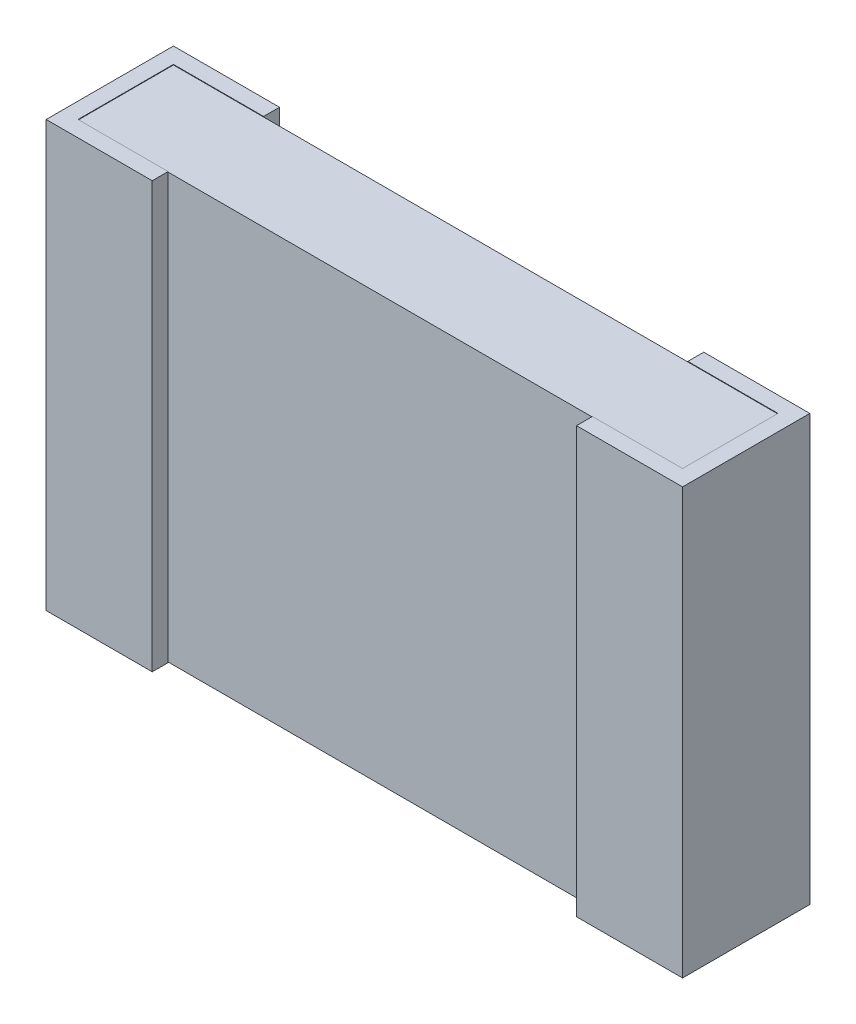
ISO-10303-21;
HEADER;
FILE_DESCRIPTION(('STEP AP214'),'2;1');
FILE_NAME('part.step','',(''),(''),'','','');
FILE_SCHEMA(('AUTOMOTIVE_DESIGN { 1 0 10303 214 1 1 1 1 }'));
ENDSEC;
DATA;
#1=APPLICATION_CONTEXT('core data for automotive mechanical design processes');
#2=APPLICATION_PROTOCOL_DEFINITION('international standard','automotive_design',2000,#1);
#3=PRODUCT_CONTEXT('',#1,'mechanical');
#4=PRODUCT('Part','Part','',(#3));
#5=PRODUCT_RELATED_PRODUCT_CATEGORY('part','',(#4));
#6=PRODUCT_DEFINITION_FORMATION('','',#4);
#7=PRODUCT_DEFINITION_CONTEXT('part definition',#1,'design');
#8=PRODUCT_DEFINITION('design','',#6,#7);
#9=PRODUCT_DEFINITION_SHAPE('','',#8);
#10=(LENGTH_UNIT() NAMED_UNIT(*) SI_UNIT(.MILLI.,.METRE.));
#11=(NAMED_UNIT(*) PLANE_ANGLE_UNIT() SI_UNIT($,.RADIAN.));
#12=(NAMED_UNIT(*) SI_UNIT($,.STERADIAN.) SOLID_ANGLE_UNIT());
#13=UNCERTAINTY_MEASURE_WITH_UNIT(LENGTH_MEASURE(1.E-05),#10,'distance_accuracy_value','');
#14=(GEOMETRIC_REPRESENTATION_CONTEXT(3) GLOBAL_UNCERTAINTY_ASSIGNED_CONTEXT((#13)) GLOBAL_UNIT_ASSIGNED_CONTEXT((#10,
#11,#12)) REPRESENTATION_CONTEXT('',''));
#15=CARTESIAN_POINT('',(0.,0.,0.));
#16=DIRECTION('',(0.,0.,1.));
#17=DIRECTION('',(1.,0.,0.));
#18=AXIS2_PLACEMENT_3D('',#15,#16,#17);
#19=CARTESIAN_POINT('',(0.0762,1.016,0.533400000000122));
#20=DIRECTION('',(0.,0.,-1.));
#21=DIRECTION('',(-1.,0.,0.));
#22=AXIS2_PLACEMENT_3D('',#19,#20,#21);
#23=PLANE('',#22);
#24=DIRECTION('',(0.,1.,0.));
#25=VECTOR('',#24,1.);
#26=CARTESIAN_POINT('',(2.54,-1.01854,0.533400000000122));
#27=LINE('',#26,#25);
#28=CARTESIAN_POINT('',(2.54,-1.016,0.533400000000122));
#29=VERTEX_POINT('',#28);
#30=CARTESIAN_POINT('',(2.54,1.016,0.533400000000122));
#31=VERTEX_POINT('',#30);
#32=EDGE_CURVE('E57',#29,#31,#27,.T.);
#33=ORIENTED_EDGE('',*,*,#32,.T.);
#34=DIRECTION('',(1.,0.,0.));
#35=VECTOR('',#34,1.);
#36=CARTESIAN_POINT('',(0.0762,1.016,0.533400000000122));
#37=LINE('',#36,#35);
#38=CARTESIAN_POINT('',(0.508,1.016,0.533400000000122));
#39=VERTEX_POINT('',#38);
#40=EDGE_CURVE('E41',#39,#31,#37,.T.);
#41=ORIENTED_EDGE('',*,*,#40,.F.);
#42=DIRECTION('',(0.,1.,0.));
#43=VECTOR('',#42,1.);
#44=CARTESIAN_POINT('',(0.508,-1.01854,0.533400000000122));
#45=LINE('',#44,#43);
#46=CARTESIAN_POINT('',(0.508,-1.016,0.533400000000122));
#47=VERTEX_POINT('',#46);
#48=EDGE_CURVE('E351',#47,#39,#45,.T.);
#49=ORIENTED_EDGE('',*,*,#48,.F.);
#50=DIRECTION('',(1.,0.,0.));
#51=VECTOR('',#50,1.);
#52=CARTESIAN_POINT('',(0.0762,-1.016,0.533400000000122));
#53=LINE('',#52,#51);
#54=EDGE_CURVE('E370',#47,#29,#53,.T.);
#55=ORIENTED_EDGE('',*,*,#54,.T.);
#56=EDGE_LOOP('',(#33,#41,#49,#55));
#57=FACE_BOUND('',#56,.T.);
#58=ADVANCED_FACE('F32',(#57),#23,.F.);
#59=CARTESIAN_POINT('',(2.9718,1.016,0.0762000000001228));
#60=DIRECTION('',(0.,0.,1.));
#61=DIRECTION('',(1.,0.,0.));
#62=AXIS2_PLACEMENT_3D('',#59,#60,#61);
#63=PLANE('',#62);
#64=DIRECTION('',(0.,1.,0.));
#65=VECTOR('',#64,1.);
#66=CARTESIAN_POINT('',(2.54000000000002,-1.01854,0.0762000000001225));
#67=LINE('',#66,#65);
#68=CARTESIAN_POINT('',(2.54000000000002,-1.016,0.0762000000001225));
#69=VERTEX_POINT('',#68);
#70=CARTESIAN_POINT('',(2.54000000000002,1.016,0.0762000000001228));
#71=VERTEX_POINT('',#70);
#72=EDGE_CURVE('E277',#69,#71,#67,.T.);
#73=ORIENTED_EDGE('',*,*,#72,.F.);
#74=DIRECTION('',(-1.,0.,0.));
#75=VECTOR('',#74,1.);
#76=CARTESIAN_POINT('',(2.9718,-1.016,0.0762000000001228));
#77=LINE('',#76,#75);
#78=CARTESIAN_POINT('',(0.507999999999976,-1.016,0.0762000000001225));
#79=VERTEX_POINT('',#78);
#80=EDGE_CURVE('E368',#69,#79,#77,.T.);
#81=ORIENTED_EDGE('',*,*,#80,.T.);
#82=DIRECTION('',(0.,1.,0.));
#83=VECTOR('',#82,1.);
#84=CARTESIAN_POINT('',(0.507999999999976,-1.01854,0.0762000000001225));
#85=LINE('',#84,#83);
#86=CARTESIAN_POINT('',(0.507999999999976,1.016,0.0762000000001225));
#87=VERTEX_POINT('',#86);
#88=EDGE_CURVE('E338',#79,#87,#85,.T.);
#89=ORIENTED_EDGE('',*,*,#88,.T.);
#90=DIRECTION('',(-1.,0.,0.));
#91=VECTOR('',#90,1.);
#92=CARTESIAN_POINT('',(2.9718,1.016,0.0762000000001228));
#93=LINE('',#92,#91);
#94=EDGE_CURVE('E49',#71,#87,#93,.T.);
#95=ORIENTED_EDGE('',*,*,#94,.F.);
#96=EDGE_LOOP('',(#73,#81,#89,#95));
#97=FACE_BOUND('',#96,.T.);
#98=ADVANCED_FACE('F34',(#97),#63,.F.);
#99=CARTESIAN_POINT('',(0.0762000000000002,1.016,0.0762000000001225));
#100=DIRECTION('',(0.,1.,0.));
#101=DIRECTION('',(0.,0.,1.));
#102=AXIS2_PLACEMENT_3D('',#99,#100,#101);
#103=PLANE('',#102);
#104=DIRECTION('',(0.,0.,-1.));
#105=VECTOR('',#104,1.);
#106=CARTESIAN_POINT('',(0.0762,1.016,0.533400000000122));
#107=LINE('',#106,#105);
#108=CARTESIAN_POINT('',(0.0762,1.016,0.533400000000122));
#109=VERTEX_POINT('',#108);
#110=CARTESIAN_POINT('',(0.0762000000000002,1.016,0.0762000000001224));
#111=VERTEX_POINT('',#110);
#112=EDGE_CURVE('E355',#109,#111,#107,.T.);
#113=ORIENTED_EDGE('',*,*,#112,.F.);
#114=EDGE_CURVE('E11',#109,#39,#37,.T.);
#115=ORIENTED_EDGE('',*,*,#114,.T.);
#116=ORIENTED_EDGE('',*,*,#40,.T.);
#117=DIRECTION('',(-1.,0.,0.));
#118=VECTOR('',#117,1.);
#119=CARTESIAN_POINT('',(0.0762000000000002,1.016,0.533400000000122));
#120=LINE('',#119,#118);
#121=CARTESIAN_POINT('',(2.9718,1.016,0.533400000000122));
#122=VERTEX_POINT('',#121);
#123=EDGE_CURVE('E208',#122,#31,#120,.T.);
#124=ORIENTED_EDGE('',*,*,#123,.F.);
#125=DIRECTION('',(0.,0.,1.));
#126=VECTOR('',#125,1.);
#127=CARTESIAN_POINT('',(2.9718,1.016,0.0762000000001228));
#128=LINE('',#127,#126);
#129=CARTESIAN_POINT('',(2.9718,1.016,0.0762000000001228));
#130=VERTEX_POINT('',#129);
#131=EDGE_CURVE('E359',#130,#122,#128,.T.);
#132=ORIENTED_EDGE('',*,*,#131,.F.);
#133=EDGE_CURVE('E357',#130,#71,#93,.T.);
#134=ORIENTED_EDGE('',*,*,#133,.T.);
#135=ORIENTED_EDGE('',*,*,#94,.T.);
#136=DIRECTION('',(-1.,0.,0.));
#137=VECTOR('',#136,1.);
#138=CARTESIAN_POINT('',(0.0762000000000002,1.016,0.0762000000001224));
#139=LINE('',#138,#137);
#140=EDGE_CURVE('E350',#87,#111,#139,.T.);
#141=ORIENTED_EDGE('',*,*,#140,.T.);
#142=EDGE_LOOP('',(#113,#115,#116,#124,#132,#134,#135,#141));
#143=FACE_BOUND('',#142,.T.);
#144=ADVANCED_FACE('F387',(#143),#103,.T.);
#145=CARTESIAN_POINT('',(0.0762000000000002,-1.016,0.0762000000001225));
#146=DIRECTION('',(0.,1.,0.));
#147=DIRECTION('',(0.,0.,1.));
#148=AXIS2_PLACEMENT_3D('',#145,#146,#147);
#149=PLANE('',#148);
#150=DIRECTION('',(0.,0.,-1.));
#151=VECTOR('',#150,1.);
#152=CARTESIAN_POINT('',(0.0762,-1.016,0.533400000000122));
#153=LINE('',#152,#151);
#154=CARTESIAN_POINT('',(0.0762,-1.016,0.533400000000122));
#155=VERTEX_POINT('',#154);
#156=CARTESIAN_POINT('',(0.0762000000000002,-1.016,0.0762000000001225));
#157=VERTEX_POINT('',#156);
#158=EDGE_CURVE('E354',#155,#157,#153,.T.);
#159=ORIENTED_EDGE('',*,*,#158,.T.);
#160=EDGE_CURVE('E364',#79,#157,#77,.T.);
#161=ORIENTED_EDGE('',*,*,#160,.F.);
#162=ORIENTED_EDGE('',*,*,#80,.F.);
#163=CARTESIAN_POINT('',(2.9718,-1.016,0.0762000000001228));
#164=VERTEX_POINT('',#163);
#165=EDGE_CURVE('E365',#164,#69,#77,.T.);
#166=ORIENTED_EDGE('',*,*,#165,.F.);
#167=DIRECTION('',(0.,0.,1.));
#168=VECTOR('',#167,1.);
#169=CARTESIAN_POINT('',(2.9718,-1.016,0.0762000000001228));
#170=LINE('',#169,#168);
#171=CARTESIAN_POINT('',(2.9718,-1.016,0.533400000000122));
#172=VERTEX_POINT('',#171);
#173=EDGE_CURVE('E367',#164,#172,#170,.T.);
#174=ORIENTED_EDGE('',*,*,#173,.T.);
#175=EDGE_CURVE('E204',#29,#172,#53,.T.);
#176=ORIENTED_EDGE('',*,*,#175,.F.);
#177=ORIENTED_EDGE('',*,*,#54,.F.);
#178=EDGE_CURVE('E36',#155,#47,#53,.T.);
#179=ORIENTED_EDGE('',*,*,#178,.F.);
#180=EDGE_LOOP('',(#159,#161,#162,#166,#174,#176,#177,#179));
#181=FACE_BOUND('',#180,.T.);
#182=ADVANCED_FACE('F384',(#181),#149,.F.);
#183=CARTESIAN_POINT('',(0.0762,-1.01854,0.533400000000122));
#184=DIRECTION('',(0.,0.,1.));
#185=DIRECTION('',(1.,0.,0.));
#186=AXIS2_PLACEMENT_3D('',#183,#184,#185);
#187=PLANE('',#186);
#188=DIRECTION('',(0.,1.,0.));
#189=VECTOR('',#188,1.);
#190=CARTESIAN_POINT('',(0.0762,-1.01854,0.533400000000122));
#191=LINE('',#190,#189);
#192=CARTESIAN_POINT('',(0.0762,-1.01854,0.533400000000122));
#193=VERTEX_POINT('',#192);
#194=EDGE_CURVE('E327',#193,#155,#191,.T.);
#195=ORIENTED_EDGE('',*,*,#194,.T.);
#196=ORIENTED_EDGE('',*,*,#178,.T.);
#197=CARTESIAN_POINT('',(0.508,-1.01854,0.533400000000122));
#198=VERTEX_POINT('',#197);
#199=EDGE_CURVE('E347',#198,#47,#45,.T.);
#200=ORIENTED_EDGE('',*,*,#199,.F.);
#201=DIRECTION('',(1.,0.,0.));
#202=VECTOR('',#201,1.);
#203=CARTESIAN_POINT('',(0.0762,-1.01854,0.533400000000122));
#204=LINE('',#203,#202);
#205=EDGE_CURVE('E282',#193,#198,#204,.T.);
#206=ORIENTED_EDGE('',*,*,#205,.F.);
#207=EDGE_LOOP('',(#195,#196,#200,#206));
#208=FACE_BOUND('',#207,.T.);
#209=ADVANCED_FACE('F374',(#208),#187,.F.);
#210=CARTESIAN_POINT('',(0.507999999999976,-1.01854,0.0762000000001225));
#211=DIRECTION('',(0.,0.,-1.));
#212=DIRECTION('',(-1.,0.,0.));
#213=AXIS2_PLACEMENT_3D('',#210,#211,#212);
#214=PLANE('',#213);
#215=CARTESIAN_POINT('',(0.507999999999976,-1.01854,0.0762000000001225));
#216=VERTEX_POINT('',#215);
#217=EDGE_CURVE('E334',#216,#79,#85,.T.);
#218=ORIENTED_EDGE('',*,*,#217,.T.);
#219=ORIENTED_EDGE('',*,*,#160,.T.);
#220=DIRECTION('',(0.,1.,0.));
#221=VECTOR('',#220,1.);
#222=CARTESIAN_POINT('',(0.0762000000000002,-1.01854,0.0762000000001224));
#223=LINE('',#222,#221);
#224=CARTESIAN_POINT('',(0.0762000000000002,-1.01854,0.0762000000001224));
#225=VERTEX_POINT('',#224);
#226=EDGE_CURVE('E331',#225,#157,#223,.T.);
#227=ORIENTED_EDGE('',*,*,#226,.F.);
#228=DIRECTION('',(-1.,0.,0.));
#229=VECTOR('',#228,1.);
#230=CARTESIAN_POINT('',(0.507999999999976,-1.01854,0.0762000000001225));
#231=LINE('',#230,#229);
#232=EDGE_CURVE('E300',#216,#225,#231,.T.);
#233=ORIENTED_EDGE('',*,*,#232,.F.);
#234=EDGE_LOOP('',(#218,#219,#227,#233));
#235=FACE_BOUND('',#234,.T.);
#236=ADVANCED_FACE('F393',(#235),#214,.F.);
#237=CARTESIAN_POINT('',(0.0762000000000002,-1.01854,0.0762000000001224));
#238=DIRECTION('',(-1.,0.,0.));
#239=DIRECTION('',(0.,0.,1.));
#240=AXIS2_PLACEMENT_3D('',#237,#238,#239);
#241=PLANE('',#240);
#242=ORIENTED_EDGE('',*,*,#226,.T.);
#243=ORIENTED_EDGE('',*,*,#158,.F.);
#244=ORIENTED_EDGE('',*,*,#194,.F.);
#245=DIRECTION('',(0.,0.,1.));
#246=VECTOR('',#245,1.);
#247=CARTESIAN_POINT('',(0.0762000000000002,-1.01854,0.0762000000001224));
#248=LINE('',#247,#246);
#249=EDGE_CURVE('E302',#225,#193,#248,.T.);
#250=ORIENTED_EDGE('',*,*,#249,.F.);
#251=EDGE_LOOP('',(#242,#243,#244,#250));
#252=FACE_BOUND('',#251,.T.);
#253=ADVANCED_FACE('F479',(#252),#241,.F.);
#254=ORIENTED_EDGE('',*,*,#114,.F.);
#255=CARTESIAN_POINT('',(0.0762,1.01854,0.533400000000122));
#256=VERTEX_POINT('',#255);
#257=EDGE_CURVE('E304',#109,#256,#191,.T.);
#258=ORIENTED_EDGE('',*,*,#257,.T.);
#259=DIRECTION('',(1.,0.,0.));
#260=VECTOR('',#259,1.);
#261=CARTESIAN_POINT('',(0.0762,1.01854,0.533400000000122));
#262=LINE('',#261,#260);
#263=CARTESIAN_POINT('',(0.508,1.01854,0.533400000000122));
#264=VERTEX_POINT('',#263);
#265=EDGE_CURVE('E281',#256,#264,#262,.T.);
#266=ORIENTED_EDGE('',*,*,#265,.T.);
#267=EDGE_CURVE('E346',#39,#264,#45,.T.);
#268=ORIENTED_EDGE('',*,*,#267,.F.);
#269=EDGE_LOOP('',(#254,#258,#266,#268));
#270=FACE_BOUND('',#269,.T.);
#271=ADVANCED_FACE('F395',(#270),#187,.F.);
#272=CARTESIAN_POINT('',(0.508,-1.01854,0.609599999999878));
#273=DIRECTION('',(1.,0.,0.));
#274=DIRECTION('',(0.,0.,-1.));
#275=AXIS2_PLACEMENT_3D('',#272,#273,#274);
#276=PLANE('',#275);
#277=DIRECTION('',(0.,0.,-1.));
#278=VECTOR('',#277,1.);
#279=CARTESIAN_POINT('',(0.508,1.01854,0.609599999999878));
#280=LINE('',#279,#278);
#281=CARTESIAN_POINT('',(0.508,1.01854,0.609599999999878));
#282=VERTEX_POINT('',#281);
#283=EDGE_CURVE('E307',#282,#264,#280,.T.);
#284=ORIENTED_EDGE('',*,*,#283,.F.);
#285=DIRECTION('',(0.,1.,0.));
#286=VECTOR('',#285,1.);
#287=CARTESIAN_POINT('',(0.508,-1.01854,0.609599999999878));
#288=LINE('',#287,#286);
#289=CARTESIAN_POINT('',(0.508,-1.01854,0.609599999999878));
#290=VERTEX_POINT('',#289);
#291=EDGE_CURVE('E344',#290,#282,#288,.T.);
#292=ORIENTED_EDGE('',*,*,#291,.F.);
#293=DIRECTION('',(0.,0.,-1.));
#294=VECTOR('',#293,1.);
#295=CARTESIAN_POINT('',(0.508,-1.01854,0.609599999999878));
#296=LINE('',#295,#294);
#297=EDGE_CURVE('E284',#290,#198,#296,.T.);
#298=ORIENTED_EDGE('',*,*,#297,.T.);
#299=ORIENTED_EDGE('',*,*,#199,.T.);
#300=ORIENTED_EDGE('',*,*,#48,.T.);
#301=ORIENTED_EDGE('',*,*,#267,.T.);
#302=EDGE_LOOP('',(#284,#292,#298,#299,#300,#301));
#303=FACE_BOUND('',#302,.T.);
#304=ADVANCED_FACE('F382',(#303),#276,.T.);
#305=CARTESIAN_POINT('',(0.,-1.01854,0.609599999999878));
#306=DIRECTION('',(0.,0.,1.));
#307=DIRECTION('',(1.,0.,0.));
#308=AXIS2_PLACEMENT_3D('',#305,#306,#307);
#309=PLANE('',#308);
#310=DIRECTION('',(1.,0.,0.));
#311=VECTOR('',#310,1.);
#312=CARTESIAN_POINT('',(0.,1.01854,0.609599999999878));
#313=LINE('',#312,#311);
#314=CARTESIAN_POINT('',(0.,1.01854,0.609599999999878));
#315=VERTEX_POINT('',#314);
#316=EDGE_CURVE('E310',#315,#282,#313,.T.);
#317=ORIENTED_EDGE('',*,*,#316,.F.);
#318=DIRECTION('',(0.,1.,0.));
#319=VECTOR('',#318,1.);
#320=CARTESIAN_POINT('',(0.,-1.01854,0.609599999999878));
#321=LINE('',#320,#319);
#322=CARTESIAN_POINT('',(0.,-1.01854,0.609599999999878));
#323=VERTEX_POINT('',#322);
#324=EDGE_CURVE('E342',#323,#315,#321,.T.);
#325=ORIENTED_EDGE('',*,*,#324,.F.);
#326=DIRECTION('',(1.,0.,0.));
#327=VECTOR('',#326,1.);
#328=CARTESIAN_POINT('',(0.,-1.01854,0.609599999999878));
#329=LINE('',#328,#327);
#330=EDGE_CURVE('E288',#323,#290,#329,.T.);
#331=ORIENTED_EDGE('',*,*,#330,.T.);
#332=ORIENTED_EDGE('',*,*,#291,.T.);
#333=EDGE_LOOP('',(#317,#325,#331,#332));
#334=FACE_BOUND('',#333,.T.);
#335=ADVANCED_FACE('F494',(#334),#309,.T.);
#336=CARTESIAN_POINT('',(0.,-1.01854,0.));
#337=DIRECTION('',(-1.,0.,0.));
#338=DIRECTION('',(0.,0.,1.));
#339=AXIS2_PLACEMENT_3D('',#336,#337,#338);
#340=PLANE('',#339);
#341=DIRECTION('',(0.,0.,1.));
#342=VECTOR('',#341,1.);
#343=CARTESIAN_POINT('',(0.,1.01854,0.));
#344=LINE('',#343,#342);
#345=CARTESIAN_POINT('',(0.,1.01854,0.));
#346=VERTEX_POINT('',#345);
#347=EDGE_CURVE('E313',#346,#315,#344,.T.);
#348=ORIENTED_EDGE('',*,*,#347,.F.);
#349=DIRECTION('',(0.,1.,0.));
#350=VECTOR('',#349,1.);
#351=CARTESIAN_POINT('',(0.,-1.01854,0.));
#352=LINE('',#351,#350);
#353=CARTESIAN_POINT('',(0.,-1.01854,0.));
#354=VERTEX_POINT('',#353);
#355=EDGE_CURVE('E340',#354,#346,#352,.T.);
#356=ORIENTED_EDGE('',*,*,#355,.F.);
#357=DIRECTION('',(0.,0.,1.));
#358=VECTOR('',#357,1.);
#359=CARTESIAN_POINT('',(0.,-1.01854,0.));
#360=LINE('',#359,#358);
#361=EDGE_CURVE('E291',#354,#323,#360,.T.);
#362=ORIENTED_EDGE('',*,*,#361,.T.);
#363=ORIENTED_EDGE('',*,*,#324,.T.);
#364=EDGE_LOOP('',(#348,#356,#362,#363));
#365=FACE_BOUND('',#364,.T.);
#366=ADVANCED_FACE('F490',(#365),#340,.T.);
#367=CARTESIAN_POINT('',(0.507999999999976,-1.01854,0.));
#368=DIRECTION('',(0.,0.,-1.));
#369=DIRECTION('',(-1.,0.,0.));
#370=AXIS2_PLACEMENT_3D('',#367,#368,#369);
#371=PLANE('',#370);
#372=DIRECTION('',(-1.,0.,0.));
#373=VECTOR('',#372,1.);
#374=CARTESIAN_POINT('',(0.507999999999976,1.01854,0.));
#375=LINE('',#374,#373);
#376=CARTESIAN_POINT('',(0.507999999999976,1.01854,0.));
#377=VERTEX_POINT('',#376);
#378=EDGE_CURVE('E316',#377,#346,#375,.T.);
#379=ORIENTED_EDGE('',*,*,#378,.F.);
#380=DIRECTION('',(0.,1.,0.));
#381=VECTOR('',#380,1.);
#382=CARTESIAN_POINT('',(0.507999999999976,-1.01854,0.));
#383=LINE('',#382,#381);
#384=CARTESIAN_POINT('',(0.507999999999976,-1.01854,0.));
#385=VERTEX_POINT('',#384);
#386=EDGE_CURVE('E337',#385,#377,#383,.T.);
#387=ORIENTED_EDGE('',*,*,#386,.F.);
#388=DIRECTION('',(-1.,0.,0.));
#389=VECTOR('',#388,1.);
#390=CARTESIAN_POINT('',(0.507999999999976,-1.01854,0.));
#391=LINE('',#390,#389);
#392=EDGE_CURVE('E294',#385,#354,#391,.T.);
#393=ORIENTED_EDGE('',*,*,#392,.T.);
#394=ORIENTED_EDGE('',*,*,#355,.T.);
#395=EDGE_LOOP('',(#379,#387,#393,#394));
#396=FACE_BOUND('',#395,.T.);
#397=ADVANCED_FACE('F486',(#396),#371,.T.);
#398=CARTESIAN_POINT('',(0.507999999999976,-1.01854,0.0762000000001225));
#399=DIRECTION('',(1.,0.,0.));
#400=DIRECTION('',(0.,0.,-1.));
#401=AXIS2_PLACEMENT_3D('',#398,#399,#400);
#402=PLANE('',#401);
#403=DIRECTION('',(0.,0.,-1.));
#404=VECTOR('',#403,1.);
#405=CARTESIAN_POINT('',(0.507999999999976,1.01854,0.0762000000001225));
#406=LINE('',#405,#404);
#407=CARTESIAN_POINT('',(0.507999999999976,1.01854,0.0762000000001225));
#408=VERTEX_POINT('',#407);
#409=EDGE_CURVE('E319',#408,#377,#406,.T.);
#410=ORIENTED_EDGE('',*,*,#409,.F.);
#411=EDGE_CURVE('E333',#87,#408,#85,.T.);
#412=ORIENTED_EDGE('',*,*,#411,.F.);
#413=ORIENTED_EDGE('',*,*,#88,.F.);
#414=ORIENTED_EDGE('',*,*,#217,.F.);
#415=DIRECTION('',(0.,0.,-1.));
#416=VECTOR('',#415,1.);
#417=CARTESIAN_POINT('',(0.507999999999976,-1.01854,0.0762000000001225));
#418=LINE('',#417,#416);
#419=EDGE_CURVE('E297',#216,#385,#418,.T.);
#420=ORIENTED_EDGE('',*,*,#419,.T.);
#421=ORIENTED_EDGE('',*,*,#386,.T.);
#422=EDGE_LOOP('',(#410,#412,#413,#414,#420,#421));
#423=FACE_BOUND('',#422,.T.);
#424=ADVANCED_FACE('F482',(#423),#402,.T.);
#425=ORIENTED_EDGE('',*,*,#140,.F.);
#426=ORIENTED_EDGE('',*,*,#411,.T.);
#427=DIRECTION('',(-1.,0.,0.));
#428=VECTOR('',#427,1.);
#429=CARTESIAN_POINT('',(0.507999999999976,1.01854,0.0762000000001225));
#430=LINE('',#429,#428);
#431=CARTESIAN_POINT('',(0.0762000000000002,1.01854,0.0762000000001224));
#432=VERTEX_POINT('',#431);
#433=EDGE_CURVE('E322',#408,#432,#430,.T.);
#434=ORIENTED_EDGE('',*,*,#433,.T.);
#435=EDGE_CURVE('E330',#111,#432,#223,.T.);
#436=ORIENTED_EDGE('',*,*,#435,.F.);
#437=EDGE_LOOP('',(#425,#426,#434,#436));
#438=FACE_BOUND('',#437,.T.);
#439=ADVANCED_FACE('F477',(#438),#214,.F.);
#440=ORIENTED_EDGE('',*,*,#112,.T.);
#441=ORIENTED_EDGE('',*,*,#435,.T.);
#442=DIRECTION('',(0.,0.,1.));
#443=VECTOR('',#442,1.);
#444=CARTESIAN_POINT('',(0.0762000000000002,1.01854,0.0762000000001224));
#445=LINE('',#444,#443);
#446=EDGE_CURVE('E285',#432,#256,#445,.T.);
#447=ORIENTED_EDGE('',*,*,#446,.T.);
#448=ORIENTED_EDGE('',*,*,#257,.F.);
#449=EDGE_LOOP('',(#440,#441,#447,#448));
#450=FACE_BOUND('',#449,.T.);
#451=ADVANCED_FACE('F470',(#450),#241,.F.);
#452=CARTESIAN_POINT('',(0.508,-1.01854,0.533400000000122));
#453=DIRECTION('',(0.,1.,0.));
#454=DIRECTION('',(0.,0.,1.));
#455=AXIS2_PLACEMENT_3D('',#452,#453,#454);
#456=PLANE('',#455);
#457=ORIENTED_EDGE('',*,*,#205,.T.);
#458=ORIENTED_EDGE('',*,*,#297,.F.);
#459=ORIENTED_EDGE('',*,*,#330,.F.);
#460=ORIENTED_EDGE('',*,*,#361,.F.);
#461=ORIENTED_EDGE('',*,*,#392,.F.);
#462=ORIENTED_EDGE('',*,*,#419,.F.);
#463=ORIENTED_EDGE('',*,*,#232,.T.);
#464=ORIENTED_EDGE('',*,*,#249,.T.);
#465=EDGE_LOOP('',(#457,#458,#459,#460,#461,#462,#463,#464));
#466=FACE_BOUND('',#465,.T.);
#467=ADVANCED_FACE('F467',(#466),#456,.F.);
#468=CARTESIAN_POINT('',(0.508,1.01854,0.533400000000122));
#469=DIRECTION('',(0.,1.,0.));
#470=DIRECTION('',(0.,0.,1.));
#471=AXIS2_PLACEMENT_3D('',#468,#469,#470);
#472=PLANE('',#471);
#473=ORIENTED_EDGE('',*,*,#265,.F.);
#474=ORIENTED_EDGE('',*,*,#446,.F.);
#475=ORIENTED_EDGE('',*,*,#433,.F.);
#476=ORIENTED_EDGE('',*,*,#409,.T.);
#477=ORIENTED_EDGE('',*,*,#378,.T.);
#478=ORIENTED_EDGE('',*,*,#347,.T.);
#479=ORIENTED_EDGE('',*,*,#316,.T.);
#480=ORIENTED_EDGE('',*,*,#283,.T.);
#481=EDGE_LOOP('',(#473,#474,#475,#476,#477,#478,#479,#480));
#482=FACE_BOUND('',#481,.T.);
#483=ADVANCED_FACE('F465',(#482),#472,.T.);
#484=CARTESIAN_POINT('',(2.9718,-1.01854,0.533400000000122));
#485=DIRECTION('',(0.,0.,-1.));
#486=DIRECTION('',(-1.,0.,0.));
#487=AXIS2_PLACEMENT_3D('',#484,#485,#486);
#488=PLANE('',#487);
#489=ORIENTED_EDGE('',*,*,#175,.T.);
#490=DIRECTION('',(0.,1.,0.));
#491=VECTOR('',#490,1.);
#492=CARTESIAN_POINT('',(2.9718,-1.01854,0.533400000000122));
#493=LINE('',#492,#491);
#494=CARTESIAN_POINT('',(2.9718,-1.01854,0.533400000000122));
#495=VERTEX_POINT('',#494);
#496=EDGE_CURVE('E199',#495,#172,#493,.T.);
#497=ORIENTED_EDGE('',*,*,#496,.F.);
#498=DIRECTION('',(-1.,0.,0.));
#499=VECTOR('',#498,1.);
#500=CARTESIAN_POINT('',(2.9718,-1.01854,0.533400000000122));
#501=LINE('',#500,#499);
#502=CARTESIAN_POINT('',(2.54,-1.01854,0.533400000000122));
#503=VERTEX_POINT('',#502);
#504=EDGE_CURVE('E203',#495,#503,#501,.T.);
#505=ORIENTED_EDGE('',*,*,#504,.T.);
#506=EDGE_CURVE('E258',#503,#29,#27,.T.);
#507=ORIENTED_EDGE('',*,*,#506,.T.);
#508=EDGE_LOOP('',(#489,#497,#505,#507));
#509=FACE_BOUND('',#508,.T.);
#510=ADVANCED_FACE('F201',(#509),#488,.T.);
#511=CARTESIAN_POINT('',(2.9718,-1.01854,0.0762000000001224));
#512=DIRECTION('',(-1.,0.,0.));
#513=DIRECTION('',(0.,0.,1.));
#514=AXIS2_PLACEMENT_3D('',#511,#512,#513);
#515=PLANE('',#514);
#516=ORIENTED_EDGE('',*,*,#173,.F.);
#517=DIRECTION('',(0.,1.,0.));
#518=VECTOR('',#517,1.);
#519=CARTESIAN_POINT('',(2.9718,-1.01854,0.0762000000001224));
#520=LINE('',#519,#518);
#521=CARTESIAN_POINT('',(2.9718,-1.01854,0.0762000000001224));
#522=VERTEX_POINT('',#521);
#523=EDGE_CURVE('E224',#522,#164,#520,.T.);
#524=ORIENTED_EDGE('',*,*,#523,.F.);
#525=DIRECTION('',(0.,0.,1.));
#526=VECTOR('',#525,1.);
#527=CARTESIAN_POINT('',(2.9718,-1.01854,0.0762000000001224));
#528=LINE('',#527,#526);
#529=EDGE_CURVE('E215',#522,#495,#528,.T.);
#530=ORIENTED_EDGE('',*,*,#529,.T.);
#531=ORIENTED_EDGE('',*,*,#496,.T.);
#532=EDGE_LOOP('',(#516,#524,#530,#531));
#533=FACE_BOUND('',#532,.T.);
#534=ADVANCED_FACE('F222',(#533),#515,.T.);
#535=CARTESIAN_POINT('',(2.54000000000002,-1.01854,0.0762000000001225));
#536=DIRECTION('',(0.,0.,1.));
#537=DIRECTION('',(1.,0.,0.));
#538=AXIS2_PLACEMENT_3D('',#535,#536,#537);
#539=PLANE('',#538);
#540=ORIENTED_EDGE('',*,*,#165,.T.);
#541=CARTESIAN_POINT('',(2.54000000000002,-1.01854,0.0762000000001225));
#542=VERTEX_POINT('',#541);
#543=EDGE_CURVE('E273',#542,#69,#67,.T.);
#544=ORIENTED_EDGE('',*,*,#543,.F.);
#545=DIRECTION('',(1.,0.,0.));
#546=VECTOR('',#545,1.);
#547=CARTESIAN_POINT('',(2.54000000000002,-1.01854,0.0762000000001225));
#548=LINE('',#547,#546);
#549=EDGE_CURVE('E225',#542,#522,#548,.T.);
#550=ORIENTED_EDGE('',*,*,#549,.T.);
#551=ORIENTED_EDGE('',*,*,#523,.T.);
#552=EDGE_LOOP('',(#540,#544,#550,#551));
#553=FACE_BOUND('',#552,.T.);
#554=ADVANCED_FACE('F408',(#553),#539,.T.);
#555=CARTESIAN_POINT('',(2.9718,1.01854,0.533400000000122));
#556=VERTEX_POINT('',#555);
#557=EDGE_CURVE('E209',#122,#556,#493,.T.);
#558=ORIENTED_EDGE('',*,*,#557,.F.);
#559=ORIENTED_EDGE('',*,*,#123,.T.);
#560=CARTESIAN_POINT('',(2.54,1.01854,0.533400000000122));
#561=VERTEX_POINT('',#560);
#562=EDGE_CURVE('E238',#31,#561,#27,.T.);
#563=ORIENTED_EDGE('',*,*,#562,.T.);
#564=DIRECTION('',(-1.,0.,0.));
#565=VECTOR('',#564,1.);
#566=CARTESIAN_POINT('',(2.9718,1.01854,0.533400000000122));
#567=LINE('',#566,#565);
#568=EDGE_CURVE('E239',#556,#561,#567,.T.);
#569=ORIENTED_EDGE('',*,*,#568,.F.);
#570=EDGE_LOOP('',(#558,#559,#563,#569));
#571=FACE_BOUND('',#570,.T.);
#572=ADVANCED_FACE('F434',(#571),#488,.T.);
#573=CARTESIAN_POINT('',(2.9718,1.01854,0.0762000000001224));
#574=VERTEX_POINT('',#573);
#575=EDGE_CURVE('E276',#130,#574,#520,.T.);
#576=ORIENTED_EDGE('',*,*,#575,.F.);
#577=ORIENTED_EDGE('',*,*,#131,.T.);
#578=ORIENTED_EDGE('',*,*,#557,.T.);
#579=DIRECTION('',(0.,0.,1.));
#580=VECTOR('',#579,1.);
#581=CARTESIAN_POINT('',(2.9718,1.01854,0.0762000000001224));
#582=LINE('',#581,#580);
#583=EDGE_CURVE('E242',#574,#556,#582,.T.);
#584=ORIENTED_EDGE('',*,*,#583,.F.);
#585=EDGE_LOOP('',(#576,#577,#578,#584));
#586=FACE_BOUND('',#585,.T.);
#587=ADVANCED_FACE('F442',(#586),#515,.T.);
#588=CARTESIAN_POINT('',(2.54000000000002,1.01854,0.0762000000001225));
#589=VERTEX_POINT('',#588);
#590=EDGE_CURVE('E272',#71,#589,#67,.T.);
#591=ORIENTED_EDGE('',*,*,#590,.F.);
#592=ORIENTED_EDGE('',*,*,#133,.F.);
#593=ORIENTED_EDGE('',*,*,#575,.T.);
#594=DIRECTION('',(1.,0.,0.));
#595=VECTOR('',#594,1.);
#596=CARTESIAN_POINT('',(2.54000000000002,1.01854,0.0762000000001225));
#597=LINE('',#596,#595);
#598=EDGE_CURVE('E245',#589,#574,#597,.T.);
#599=ORIENTED_EDGE('',*,*,#598,.F.);
#600=EDGE_LOOP('',(#591,#592,#593,#599));
#601=FACE_BOUND('',#600,.T.);
#602=ADVANCED_FACE('F447',(#601),#539,.T.);
#603=CARTESIAN_POINT('',(2.54000000000002,-1.01854,0.0762000000001225));
#604=DIRECTION('',(1.,0.,0.));
#605=DIRECTION('',(0.,0.,-1.));
#606=AXIS2_PLACEMENT_3D('',#603,#604,#605);
#607=PLANE('',#606);
#608=DIRECTION('',(0.,0.,-1.));
#609=VECTOR('',#608,1.);
#610=CARTESIAN_POINT('',(2.54000000000002,1.01854,0.0762000000001225));
#611=LINE('',#610,#609);
#612=CARTESIAN_POINT('',(2.54000000000002,1.01854,0.));
#613=VERTEX_POINT('',#612);
#614=EDGE_CURVE('E248',#589,#613,#611,.T.);
#615=ORIENTED_EDGE('',*,*,#614,.T.);
#616=DIRECTION('',(0.,1.,0.));
#617=VECTOR('',#616,1.);
#618=CARTESIAN_POINT('',(2.54000000000002,-1.01854,0.));
#619=LINE('',#618,#617);
#620=CARTESIAN_POINT('',(2.54000000000002,-1.01854,0.));
#621=VERTEX_POINT('',#620);
#622=EDGE_CURVE('E269',#621,#613,#619,.T.);
#623=ORIENTED_EDGE('',*,*,#622,.F.);
#624=DIRECTION('',(0.,0.,-1.));
#625=VECTOR('',#624,1.);
#626=CARTESIAN_POINT('',(2.54000000000002,-1.01854,0.0762000000001225));
#627=LINE('',#626,#625);
#628=EDGE_CURVE('E227',#542,#621,#627,.T.);
#629=ORIENTED_EDGE('',*,*,#628,.F.);
#630=ORIENTED_EDGE('',*,*,#543,.T.);
#631=ORIENTED_EDGE('',*,*,#72,.T.);
#632=ORIENTED_EDGE('',*,*,#590,.T.);
#633=EDGE_LOOP('',(#615,#623,#629,#630,#631,#632));
#634=FACE_BOUND('',#633,.T.);
#635=ADVANCED_FACE('F410',(#634),#607,.F.);
#636=CARTESIAN_POINT('',(2.54000000000002,-1.01854,0.));
#637=DIRECTION('',(0.,0.,1.));
#638=DIRECTION('',(1.,0.,0.));
#639=AXIS2_PLACEMENT_3D('',#636,#637,#638);
#640=PLANE('',#639);
#641=DIRECTION('',(1.,0.,0.));
#642=VECTOR('',#641,1.);
#643=CARTESIAN_POINT('',(2.54000000000002,1.01854,0.));
#644=LINE('',#643,#642);
#645=CARTESIAN_POINT('',(3.048,1.01854,0.));
#646=VERTEX_POINT('',#645);
#647=EDGE_CURVE('E250',#613,#646,#644,.T.);
#648=ORIENTED_EDGE('',*,*,#647,.T.);
#649=DIRECTION('',(0.,1.,0.));
#650=VECTOR('',#649,1.);
#651=CARTESIAN_POINT('',(3.048,-1.01854,0.));
#652=LINE('',#651,#650);
#653=CARTESIAN_POINT('',(3.048,-1.01854,0.));
#654=VERTEX_POINT('',#653);
#655=EDGE_CURVE('E266',#654,#646,#652,.T.);
#656=ORIENTED_EDGE('',*,*,#655,.F.);
#657=DIRECTION('',(1.,0.,0.));
#658=VECTOR('',#657,1.);
#659=CARTESIAN_POINT('',(2.54000000000002,-1.01854,0.));
#660=LINE('',#659,#658);
#661=EDGE_CURVE('E231',#621,#654,#660,.T.);
#662=ORIENTED_EDGE('',*,*,#661,.F.);
#663=ORIENTED_EDGE('',*,*,#622,.T.);
#664=EDGE_LOOP('',(#648,#656,#662,#663));
#665=FACE_BOUND('',#664,.T.);
#666=ADVANCED_FACE('F417',(#665),#640,.F.);
#667=CARTESIAN_POINT('',(3.048,-1.01854,0.));
#668=DIRECTION('',(-1.,0.,0.));
#669=DIRECTION('',(0.,0.,1.));
#670=AXIS2_PLACEMENT_3D('',#667,#668,#669);
#671=PLANE('',#670);
#672=DIRECTION('',(0.,0.,1.));
#673=VECTOR('',#672,1.);
#674=CARTESIAN_POINT('',(3.048,1.01854,0.));
#675=LINE('',#674,#673);
#676=CARTESIAN_POINT('',(3.048,1.01854,0.609599999999878));
#677=VERTEX_POINT('',#676);
#678=EDGE_CURVE('E252',#646,#677,#675,.T.);
#679=ORIENTED_EDGE('',*,*,#678,.T.);
#680=DIRECTION('',(0.,1.,0.));
#681=VECTOR('',#680,1.);
#682=CARTESIAN_POINT('',(3.048,-1.01854,0.609599999999878));
#683=LINE('',#682,#681);
#684=CARTESIAN_POINT('',(3.048,-1.01854,0.609599999999878));
#685=VERTEX_POINT('',#684);
#686=EDGE_CURVE('E263',#685,#677,#683,.T.);
#687=ORIENTED_EDGE('',*,*,#686,.F.);
#688=DIRECTION('',(0.,0.,1.));
#689=VECTOR('',#688,1.);
#690=CARTESIAN_POINT('',(3.048,-1.01854,0.));
#691=LINE('',#690,#689);
#692=EDGE_CURVE('E233',#654,#685,#691,.T.);
#693=ORIENTED_EDGE('',*,*,#692,.F.);
#694=ORIENTED_EDGE('',*,*,#655,.T.);
#695=EDGE_LOOP('',(#679,#687,#693,#694));
#696=FACE_BOUND('',#695,.T.);
#697=ADVANCED_FACE('F421',(#696),#671,.F.);
#698=CARTESIAN_POINT('',(3.048,-1.01854,0.609599999999878));
#699=DIRECTION('',(0.,0.,-1.));
#700=DIRECTION('',(-1.,0.,0.));
#701=AXIS2_PLACEMENT_3D('',#698,#699,#700);
#702=PLANE('',#701);
#703=DIRECTION('',(-1.,0.,0.));
#704=VECTOR('',#703,1.);
#705=CARTESIAN_POINT('',(3.048,1.01854,0.609599999999878));
#706=LINE('',#705,#704);
#707=CARTESIAN_POINT('',(2.54,1.01854,0.609599999999878));
#708=VERTEX_POINT('',#707);
#709=EDGE_CURVE('E254',#677,#708,#706,.T.);
#710=ORIENTED_EDGE('',*,*,#709,.T.);
#711=DIRECTION('',(0.,1.,0.));
#712=VECTOR('',#711,1.);
#713=CARTESIAN_POINT('',(2.54,-1.01854,0.609599999999878));
#714=LINE('',#713,#712);
#715=CARTESIAN_POINT('',(2.54,-1.01854,0.609599999999878));
#716=VERTEX_POINT('',#715);
#717=EDGE_CURVE('E260',#716,#708,#714,.T.);
#718=ORIENTED_EDGE('',*,*,#717,.F.);
#719=DIRECTION('',(-1.,0.,0.));
#720=VECTOR('',#719,1.);
#721=CARTESIAN_POINT('',(3.048,-1.01854,0.609599999999878));
#722=LINE('',#721,#720);
#723=EDGE_CURVE('E235',#685,#716,#722,.T.);
#724=ORIENTED_EDGE('',*,*,#723,.F.);
#725=ORIENTED_EDGE('',*,*,#686,.T.);
#726=EDGE_LOOP('',(#710,#718,#724,#725));
#727=FACE_BOUND('',#726,.T.);
#728=ADVANCED_FACE('F426',(#727),#702,.F.);
#729=CARTESIAN_POINT('',(2.54,-1.01854,0.609599999999878));
#730=DIRECTION('',(1.,0.,0.));
#731=DIRECTION('',(0.,0.,-1.));
#732=AXIS2_PLACEMENT_3D('',#729,#730,#731);
#733=PLANE('',#732);
#734=DIRECTION('',(0.,0.,-1.));
#735=VECTOR('',#734,1.);
#736=CARTESIAN_POINT('',(2.54,1.01854,0.609599999999878));
#737=LINE('',#736,#735);
#738=EDGE_CURVE('E220',#708,#561,#737,.T.);
#739=ORIENTED_EDGE('',*,*,#738,.T.);
#740=ORIENTED_EDGE('',*,*,#562,.F.);
#741=ORIENTED_EDGE('',*,*,#32,.F.);
#742=ORIENTED_EDGE('',*,*,#506,.F.);
#743=DIRECTION('',(0.,0.,-1.));
#744=VECTOR('',#743,1.);
#745=CARTESIAN_POINT('',(2.54,-1.01854,0.609599999999878));
#746=LINE('',#745,#744);
#747=EDGE_CURVE('E218',#716,#503,#746,.T.);
#748=ORIENTED_EDGE('',*,*,#747,.F.);
#749=ORIENTED_EDGE('',*,*,#717,.T.);
#750=EDGE_LOOP('',(#739,#740,#741,#742,#748,#749));
#751=FACE_BOUND('',#750,.T.);
#752=ADVANCED_FACE('F429',(#751),#733,.F.);
#753=CARTESIAN_POINT('',(2.54,-1.01854,0.533400000000122));
#754=DIRECTION('',(0.,1.,0.));
#755=DIRECTION('',(0.,0.,1.));
#756=AXIS2_PLACEMENT_3D('',#753,#754,#755);
#757=PLANE('',#756);
#758=ORIENTED_EDGE('',*,*,#504,.F.);
#759=ORIENTED_EDGE('',*,*,#529,.F.);
#760=ORIENTED_EDGE('',*,*,#549,.F.);
#761=ORIENTED_EDGE('',*,*,#628,.T.);
#762=ORIENTED_EDGE('',*,*,#661,.T.);
#763=ORIENTED_EDGE('',*,*,#692,.T.);
#764=ORIENTED_EDGE('',*,*,#723,.T.);
#765=ORIENTED_EDGE('',*,*,#747,.T.);
#766=EDGE_LOOP('',(#758,#759,#760,#761,#762,#763,#764,#765));
#767=FACE_BOUND('',#766,.T.);
#768=ADVANCED_FACE('F213',(#767),#757,.F.);
#769=CARTESIAN_POINT('',(2.54,1.01854,0.533400000000122));
#770=DIRECTION('',(0.,1.,0.));
#771=DIRECTION('',(0.,0.,1.));
#772=AXIS2_PLACEMENT_3D('',#769,#770,#771);
#773=PLANE('',#772);
#774=ORIENTED_EDGE('',*,*,#568,.T.);
#775=ORIENTED_EDGE('',*,*,#738,.F.);
#776=ORIENTED_EDGE('',*,*,#709,.F.);
#777=ORIENTED_EDGE('',*,*,#678,.F.);
#778=ORIENTED_EDGE('',*,*,#647,.F.);
#779=ORIENTED_EDGE('',*,*,#614,.F.);
#780=ORIENTED_EDGE('',*,*,#598,.T.);
#781=ORIENTED_EDGE('',*,*,#583,.T.);
#782=EDGE_LOOP('',(#774,#775,#776,#777,#778,#779,#780,#781));
#783=FACE_BOUND('',#782,.T.);
#784=ADVANCED_FACE('F436',(#783),#773,.T.);
#785=CLOSED_SHELL('',(#58,#98,#144,#182,#209,#236,#253,#271,#304,#335,#366,#397,#424,#439,#451,
#467,#483,#510,#534,#554,#572,#587,#602,#635,#666,#697,#728,#752,#768,#784));
#786=MANIFOLD_SOLID_BREP('B2',#785);
#787=ADVANCED_BREP_SHAPE_REPRESENTATION('',(#18,#786),#14);
#788=SHAPE_DEFINITION_REPRESENTATION(#9,#787);
ENDSEC;
END-ISO-10303-21;
